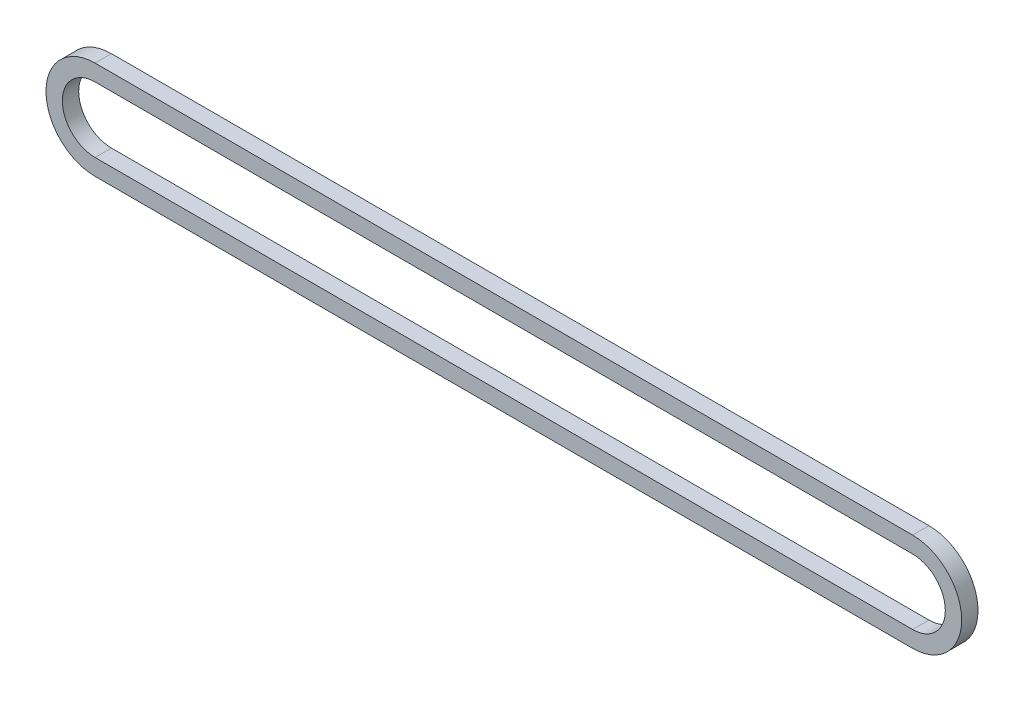
ISO-10303-21;
HEADER;
FILE_DESCRIPTION(('STEP AP214'),'2;1');
FILE_NAME('part.step','',(''),(''),'','','');
FILE_SCHEMA(('AUTOMOTIVE_DESIGN { 1 0 10303 214 1 1 1 1 }'));
ENDSEC;
DATA;
#1=APPLICATION_CONTEXT('core data for automotive mechanical design processes');
#2=APPLICATION_PROTOCOL_DEFINITION('international standard','automotive_design',2000,#1);
#3=PRODUCT_CONTEXT('',#1,'mechanical');
#4=PRODUCT('Part','Part','',(#3));
#5=PRODUCT_RELATED_PRODUCT_CATEGORY('part','',(#4));
#6=PRODUCT_DEFINITION_FORMATION('','',#4);
#7=PRODUCT_DEFINITION_CONTEXT('part definition',#1,'design');
#8=PRODUCT_DEFINITION('design','',#6,#7);
#9=PRODUCT_DEFINITION_SHAPE('','',#8);
#10=(LENGTH_UNIT() NAMED_UNIT(*) SI_UNIT(.MILLI.,.METRE.));
#11=(NAMED_UNIT(*) PLANE_ANGLE_UNIT() SI_UNIT($,.RADIAN.));
#12=(NAMED_UNIT(*) SI_UNIT($,.STERADIAN.) SOLID_ANGLE_UNIT());
#13=UNCERTAINTY_MEASURE_WITH_UNIT(LENGTH_MEASURE(1.E-05),#10,'distance_accuracy_value','');
#14=(GEOMETRIC_REPRESENTATION_CONTEXT(3) GLOBAL_UNCERTAINTY_ASSIGNED_CONTEXT((#13)) GLOBAL_UNIT_ASSIGNED_CONTEXT((#10,
#11,#12)) REPRESENTATION_CONTEXT('',''));
#15=CARTESIAN_POINT('',(0.,0.,0.));
#16=DIRECTION('',(0.,0.,1.));
#17=DIRECTION('',(1.,0.,0.));
#18=AXIS2_PLACEMENT_3D('',#15,#16,#17);
#19=CARTESIAN_POINT('',(-52.3145705245356,0.,2.));
#20=DIRECTION('',(0.,0.,1.));
#21=DIRECTION('',(1.,0.,0.));
#22=AXIS2_PLACEMENT_3D('',#19,#20,#21);
#23=PLANE('',#22);
#24=CARTESIAN_POINT('',(-52.3145705245356,0.,2.));
#25=DIRECTION('',(0.,0.,1.));
#26=DIRECTION('',(1.,0.,0.));
#27=AXIS2_PLACEMENT_3D('',#24,#25,#26);
#28=CIRCLE('',#27,6.);
#29=CARTESIAN_POINT('',(-52.3145705245356,6.,2.));
#30=VERTEX_POINT('',#29);
#31=CARTESIAN_POINT('',(-52.3145705245356,-6.,2.));
#32=VERTEX_POINT('',#31);
#33=EDGE_CURVE('E132',#30,#32,#28,.T.);
#34=ORIENTED_EDGE('',*,*,#33,.T.);
#35=DIRECTION('',(1.,0.,0.));
#36=VECTOR('',#35,1.);
#37=CARTESIAN_POINT('',(-52.3145705245356,-6.,2.));
#38=LINE('',#37,#36);
#39=CARTESIAN_POINT('',(47.6854294754644,-6.,2.));
#40=VERTEX_POINT('',#39);
#41=EDGE_CURVE('E135',#32,#40,#38,.T.);
#42=ORIENTED_EDGE('',*,*,#41,.T.);
#43=CARTESIAN_POINT('',(47.6854294754644,0.,2.));
#44=DIRECTION('',(0.,0.,1.));
#45=DIRECTION('',(1.,0.,0.));
#46=AXIS2_PLACEMENT_3D('',#43,#44,#45);
#47=CIRCLE('',#46,6.);
#48=CARTESIAN_POINT('',(47.6854294754644,6.,2.));
#49=VERTEX_POINT('',#48);
#50=EDGE_CURVE('E138',#40,#49,#47,.T.);
#51=ORIENTED_EDGE('',*,*,#50,.T.);
#52=DIRECTION('',(-1.,0.,0.));
#53=VECTOR('',#52,1.);
#54=CARTESIAN_POINT('',(-52.3145705245356,6.,2.));
#55=LINE('',#54,#53);
#56=EDGE_CURVE('E140',#49,#30,#55,.T.);
#57=ORIENTED_EDGE('',*,*,#56,.T.);
#58=EDGE_LOOP('',(#34,#42,#51,#57));
#59=FACE_BOUND('',#58,.T.);
#60=DIRECTION('',(1.,0.,0.));
#61=VECTOR('',#60,1.);
#62=CARTESIAN_POINT('',(-52.3145705245356,-4.,2.));
#63=LINE('',#62,#61);
#64=CARTESIAN_POINT('',(-52.3145705245356,-4.,2.));
#65=VERTEX_POINT('',#64);
#66=CARTESIAN_POINT('',(47.6854294754644,-4.,2.));
#67=VERTEX_POINT('',#66);
#68=EDGE_CURVE('E104',#65,#67,#63,.T.);
#69=ORIENTED_EDGE('',*,*,#68,.F.);
#70=CARTESIAN_POINT('',(-52.3145705245356,0.,2.));
#71=DIRECTION('',(0.,0.,1.));
#72=DIRECTION('',(1.,0.,0.));
#73=AXIS2_PLACEMENT_3D('',#70,#71,#72);
#74=CIRCLE('',#73,4.);
#75=CARTESIAN_POINT('',(-52.3145705245356,4.,2.));
#76=VERTEX_POINT('',#75);
#77=EDGE_CURVE('E96',#76,#65,#74,.T.);
#78=ORIENTED_EDGE('',*,*,#77,.F.);
#79=DIRECTION('',(-1.,0.,0.));
#80=VECTOR('',#79,1.);
#81=CARTESIAN_POINT('',(-52.3145705245356,4.,2.));
#82=LINE('',#81,#80);
#83=CARTESIAN_POINT('',(47.6854294754644,4.,2.));
#84=VERTEX_POINT('',#83);
#85=EDGE_CURVE('E118',#84,#76,#82,.T.);
#86=ORIENTED_EDGE('',*,*,#85,.F.);
#87=CARTESIAN_POINT('',(47.6854294754644,0.,2.));
#88=DIRECTION('',(0.,0.,1.));
#89=DIRECTION('',(1.,0.,0.));
#90=AXIS2_PLACEMENT_3D('',#87,#88,#89);
#91=CIRCLE('',#90,4.);
#92=EDGE_CURVE('E116',#67,#84,#91,.T.);
#93=ORIENTED_EDGE('',*,*,#92,.F.);
#94=EDGE_LOOP('',(#69,#78,#86,#93));
#95=FACE_BOUND('',#94,.T.);
#96=ADVANCED_FACE('F31',(#59,#95),#23,.T.);
#97=CARTESIAN_POINT('',(-52.3145705245356,0.,0.));
#98=DIRECTION('',(0.,0.,1.));
#99=DIRECTION('',(1.,0.,0.));
#100=AXIS2_PLACEMENT_3D('',#97,#98,#99);
#101=PLANE('',#100);
#102=CARTESIAN_POINT('',(-52.3145705245356,0.,0.));
#103=DIRECTION('',(0.,0.,1.));
#104=DIRECTION('',(1.,0.,0.));
#105=AXIS2_PLACEMENT_3D('',#102,#103,#104);
#106=CIRCLE('',#105,6.);
#107=CARTESIAN_POINT('',(-52.3145705245356,6.,0.));
#108=VERTEX_POINT('',#107);
#109=CARTESIAN_POINT('',(-52.3145705245356,-6.,0.));
#110=VERTEX_POINT('',#109);
#111=EDGE_CURVE('E112',#108,#110,#106,.T.);
#112=ORIENTED_EDGE('',*,*,#111,.F.);
#113=DIRECTION('',(-1.,0.,0.));
#114=VECTOR('',#113,1.);
#115=CARTESIAN_POINT('',(-52.3145705245356,6.,0.));
#116=LINE('',#115,#114);
#117=CARTESIAN_POINT('',(47.6854294754644,6.,0.));
#118=VERTEX_POINT('',#117);
#119=EDGE_CURVE('E136',#118,#108,#116,.T.);
#120=ORIENTED_EDGE('',*,*,#119,.F.);
#121=CARTESIAN_POINT('',(47.6854294754644,0.,0.));
#122=DIRECTION('',(0.,0.,1.));
#123=DIRECTION('',(1.,0.,0.));
#124=AXIS2_PLACEMENT_3D('',#121,#122,#123);
#125=CIRCLE('',#124,6.);
#126=CARTESIAN_POINT('',(47.6854294754644,-6.,0.));
#127=VERTEX_POINT('',#126);
#128=EDGE_CURVE('E147',#127,#118,#125,.T.);
#129=ORIENTED_EDGE('',*,*,#128,.F.);
#130=DIRECTION('',(1.,0.,0.));
#131=VECTOR('',#130,1.);
#132=CARTESIAN_POINT('',(-52.3145705245356,-6.,0.));
#133=LINE('',#132,#131);
#134=EDGE_CURVE('E145',#110,#127,#133,.T.);
#135=ORIENTED_EDGE('',*,*,#134,.F.);
#136=EDGE_LOOP('',(#112,#120,#129,#135));
#137=FACE_BOUND('',#136,.T.);
#138=CARTESIAN_POINT('',(-52.3145705245356,0.,0.));
#139=DIRECTION('',(0.,0.,1.));
#140=DIRECTION('',(1.,0.,0.));
#141=AXIS2_PLACEMENT_3D('',#138,#139,#140);
#142=CIRCLE('',#141,4.);
#143=CARTESIAN_POINT('',(-52.3145705245356,4.,0.));
#144=VERTEX_POINT('',#143);
#145=CARTESIAN_POINT('',(-52.3145705245356,-4.,0.));
#146=VERTEX_POINT('',#145);
#147=EDGE_CURVE('E54',#144,#146,#142,.T.);
#148=ORIENTED_EDGE('',*,*,#147,.T.);
#149=DIRECTION('',(1.,0.,0.));
#150=VECTOR('',#149,1.);
#151=CARTESIAN_POINT('',(-52.3145705245356,-4.,0.));
#152=LINE('',#151,#150);
#153=CARTESIAN_POINT('',(47.6854294754644,-4.,0.));
#154=VERTEX_POINT('',#153);
#155=EDGE_CURVE('E111',#146,#154,#152,.T.);
#156=ORIENTED_EDGE('',*,*,#155,.T.);
#157=CARTESIAN_POINT('',(47.6854294754644,0.,0.));
#158=DIRECTION('',(0.,0.,1.));
#159=DIRECTION('',(1.,0.,0.));
#160=AXIS2_PLACEMENT_3D('',#157,#158,#159);
#161=CIRCLE('',#160,4.);
#162=CARTESIAN_POINT('',(47.6854294754644,4.,0.));
#163=VERTEX_POINT('',#162);
#164=EDGE_CURVE('E124',#154,#163,#161,.T.);
#165=ORIENTED_EDGE('',*,*,#164,.T.);
#166=DIRECTION('',(-1.,0.,0.));
#167=VECTOR('',#166,1.);
#168=CARTESIAN_POINT('',(-52.3145705245356,4.,0.));
#169=LINE('',#168,#167);
#170=EDGE_CURVE('E105',#163,#144,#169,.T.);
#171=ORIENTED_EDGE('',*,*,#170,.T.);
#172=EDGE_LOOP('',(#148,#156,#165,#171));
#173=FACE_BOUND('',#172,.T.);
#174=ADVANCED_FACE('F165',(#137,#173),#101,.F.);
#175=CARTESIAN_POINT('',(-52.3145705245356,0.,2.));
#176=DIRECTION('',(0.,0.,-1.));
#177=DIRECTION('',(-1.,0.,0.));
#178=AXIS2_PLACEMENT_3D('',#175,#176,#177);
#179=CYLINDRICAL_SURFACE('',#178,6.);
#180=ORIENTED_EDGE('',*,*,#111,.T.);
#181=DIRECTION('',(0.,0.,-1.));
#182=VECTOR('',#181,1.);
#183=CARTESIAN_POINT('',(-52.3145705245356,-6.,2.));
#184=LINE('',#183,#182);
#185=EDGE_CURVE('E11',#32,#110,#184,.T.);
#186=ORIENTED_EDGE('',*,*,#185,.F.);
#187=ORIENTED_EDGE('',*,*,#33,.F.);
#188=DIRECTION('',(0.,0.,-1.));
#189=VECTOR('',#188,1.);
#190=CARTESIAN_POINT('',(-52.3145705245356,6.,2.));
#191=LINE('',#190,#189);
#192=EDGE_CURVE('E142',#30,#108,#191,.T.);
#193=ORIENTED_EDGE('',*,*,#192,.T.);
#194=EDGE_LOOP('',(#180,#186,#187,#193));
#195=FACE_BOUND('',#194,.T.);
#196=ADVANCED_FACE('F33',(#195),#179,.T.);
#197=CARTESIAN_POINT('',(-52.3145705245356,-6.,2.));
#198=DIRECTION('',(0.,1.,0.));
#199=DIRECTION('',(0.,0.,1.));
#200=AXIS2_PLACEMENT_3D('',#197,#198,#199);
#201=PLANE('',#200);
#202=ORIENTED_EDGE('',*,*,#134,.T.);
#203=DIRECTION('',(0.,0.,-1.));
#204=VECTOR('',#203,1.);
#205=CARTESIAN_POINT('',(47.6854294754644,-6.,2.));
#206=LINE('',#205,#204);
#207=EDGE_CURVE('E39',#40,#127,#206,.T.);
#208=ORIENTED_EDGE('',*,*,#207,.F.);
#209=ORIENTED_EDGE('',*,*,#41,.F.);
#210=ORIENTED_EDGE('',*,*,#185,.T.);
#211=EDGE_LOOP('',(#202,#208,#209,#210));
#212=FACE_BOUND('',#211,.T.);
#213=ADVANCED_FACE('F175',(#212),#201,.F.);
#214=CARTESIAN_POINT('',(47.6854294754644,0.,2.));
#215=DIRECTION('',(0.,0.,-1.));
#216=DIRECTION('',(-1.,0.,0.));
#217=AXIS2_PLACEMENT_3D('',#214,#215,#216);
#218=CYLINDRICAL_SURFACE('',#217,6.);
#219=ORIENTED_EDGE('',*,*,#128,.T.);
#220=DIRECTION('',(0.,0.,-1.));
#221=VECTOR('',#220,1.);
#222=CARTESIAN_POINT('',(47.6854294754644,6.,2.));
#223=LINE('',#222,#221);
#224=EDGE_CURVE('E152',#49,#118,#223,.T.);
#225=ORIENTED_EDGE('',*,*,#224,.F.);
#226=ORIENTED_EDGE('',*,*,#50,.F.);
#227=ORIENTED_EDGE('',*,*,#207,.T.);
#228=EDGE_LOOP('',(#219,#225,#226,#227));
#229=FACE_BOUND('',#228,.T.);
#230=ADVANCED_FACE('F159',(#229),#218,.T.);
#231=CARTESIAN_POINT('',(-52.3145705245356,6.,2.));
#232=DIRECTION('',(0.,-1.,0.));
#233=DIRECTION('',(0.,0.,-1.));
#234=AXIS2_PLACEMENT_3D('',#231,#232,#233);
#235=PLANE('',#234);
#236=ORIENTED_EDGE('',*,*,#119,.T.);
#237=ORIENTED_EDGE('',*,*,#192,.F.);
#238=ORIENTED_EDGE('',*,*,#56,.F.);
#239=ORIENTED_EDGE('',*,*,#224,.T.);
#240=EDGE_LOOP('',(#236,#237,#238,#239));
#241=FACE_BOUND('',#240,.T.);
#242=ADVANCED_FACE('F169',(#241),#235,.F.);
#243=CARTESIAN_POINT('',(-52.3145705245356,0.,2.));
#244=DIRECTION('',(0.,0.,-1.));
#245=DIRECTION('',(-1.,0.,0.));
#246=AXIS2_PLACEMENT_3D('',#243,#244,#245);
#247=CYLINDRICAL_SURFACE('',#246,4.);
#248=ORIENTED_EDGE('',*,*,#147,.F.);
#249=DIRECTION('',(0.,0.,-1.));
#250=VECTOR('',#249,1.);
#251=CARTESIAN_POINT('',(-52.3145705245356,4.,2.));
#252=LINE('',#251,#250);
#253=EDGE_CURVE('E100',#76,#144,#252,.T.);
#254=ORIENTED_EDGE('',*,*,#253,.F.);
#255=ORIENTED_EDGE('',*,*,#77,.T.);
#256=DIRECTION('',(0.,0.,-1.));
#257=VECTOR('',#256,1.);
#258=CARTESIAN_POINT('',(-52.3145705245356,-4.,2.));
#259=LINE('',#258,#257);
#260=EDGE_CURVE('E99',#65,#146,#259,.T.);
#261=ORIENTED_EDGE('',*,*,#260,.T.);
#262=EDGE_LOOP('',(#248,#254,#255,#261));
#263=FACE_BOUND('',#262,.T.);
#264=ADVANCED_FACE('F98',(#263),#247,.F.);
#265=CARTESIAN_POINT('',(-52.3145705245356,-4.,2.));
#266=DIRECTION('',(0.,1.,0.));
#267=DIRECTION('',(0.,0.,1.));
#268=AXIS2_PLACEMENT_3D('',#265,#266,#267);
#269=PLANE('',#268);
#270=ORIENTED_EDGE('',*,*,#155,.F.);
#271=ORIENTED_EDGE('',*,*,#260,.F.);
#272=ORIENTED_EDGE('',*,*,#68,.T.);
#273=DIRECTION('',(0.,0.,-1.));
#274=VECTOR('',#273,1.);
#275=CARTESIAN_POINT('',(47.6854294754644,-4.,2.));
#276=LINE('',#275,#274);
#277=EDGE_CURVE('E113',#67,#154,#276,.T.);
#278=ORIENTED_EDGE('',*,*,#277,.T.);
#279=EDGE_LOOP('',(#270,#271,#272,#278));
#280=FACE_BOUND('',#279,.T.);
#281=ADVANCED_FACE('F108',(#280),#269,.T.);
#282=CARTESIAN_POINT('',(47.6854294754644,0.,2.));
#283=DIRECTION('',(0.,0.,-1.));
#284=DIRECTION('',(-1.,0.,0.));
#285=AXIS2_PLACEMENT_3D('',#282,#283,#284);
#286=CYLINDRICAL_SURFACE('',#285,4.);
#287=ORIENTED_EDGE('',*,*,#164,.F.);
#288=ORIENTED_EDGE('',*,*,#277,.F.);
#289=ORIENTED_EDGE('',*,*,#92,.T.);
#290=DIRECTION('',(0.,0.,-1.));
#291=VECTOR('',#290,1.);
#292=CARTESIAN_POINT('',(47.6854294754644,4.,2.));
#293=LINE('',#292,#291);
#294=EDGE_CURVE('E46',#84,#163,#293,.T.);
#295=ORIENTED_EDGE('',*,*,#294,.T.);
#296=EDGE_LOOP('',(#287,#288,#289,#295));
#297=FACE_BOUND('',#296,.T.);
#298=ADVANCED_FACE('F198',(#297),#286,.F.);
#299=CARTESIAN_POINT('',(-52.3145705245356,4.,2.));
#300=DIRECTION('',(0.,-1.,0.));
#301=DIRECTION('',(0.,0.,-1.));
#302=AXIS2_PLACEMENT_3D('',#299,#300,#301);
#303=PLANE('',#302);
#304=ORIENTED_EDGE('',*,*,#170,.F.);
#305=ORIENTED_EDGE('',*,*,#294,.F.);
#306=ORIENTED_EDGE('',*,*,#85,.T.);
#307=ORIENTED_EDGE('',*,*,#253,.T.);
#308=EDGE_LOOP('',(#304,#305,#306,#307));
#309=FACE_BOUND('',#308,.T.);
#310=ADVANCED_FACE('F202',(#309),#303,.T.);
#311=CLOSED_SHELL('',(#96,#174,#196,#213,#230,#242,#264,#281,#298,#310));
#312=MANIFOLD_SOLID_BREP('B2',#311);
#313=ADVANCED_BREP_SHAPE_REPRESENTATION('',(#18,#312),#14);
#314=SHAPE_DEFINITION_REPRESENTATION(#9,#313);
ENDSEC;
END-ISO-10303-21;
